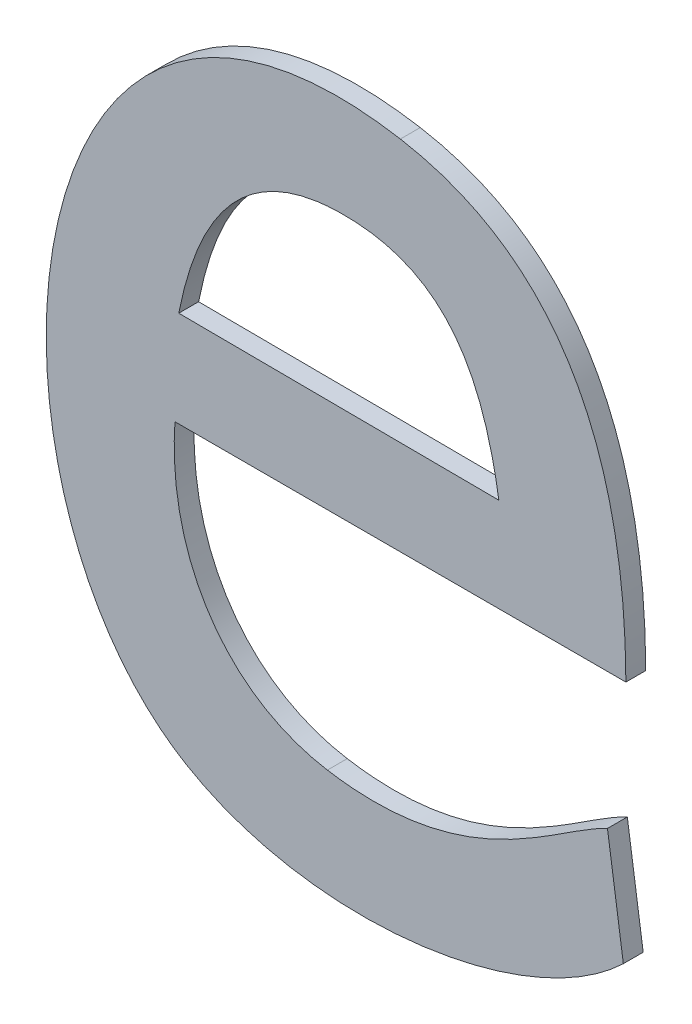
ISO-10303-21;
HEADER;
FILE_DESCRIPTION(('STEP AP214'),'2;1');
FILE_NAME('part.step','',(''),(''),'','','');
FILE_SCHEMA(('AUTOMOTIVE_DESIGN { 1 0 10303 214 1 1 1 1 }'));
ENDSEC;
DATA;
#1=APPLICATION_CONTEXT('core data for automotive mechanical design processes');
#2=APPLICATION_PROTOCOL_DEFINITION('international standard','automotive_design',2000,#1);
#3=PRODUCT_CONTEXT('',#1,'mechanical');
#4=PRODUCT('Part','Part','',(#3));
#5=PRODUCT_RELATED_PRODUCT_CATEGORY('part','',(#4));
#6=PRODUCT_DEFINITION_FORMATION('','',#4);
#7=PRODUCT_DEFINITION_CONTEXT('part definition',#1,'design');
#8=PRODUCT_DEFINITION('design','',#6,#7);
#9=PRODUCT_DEFINITION_SHAPE('','',#8);
#10=(LENGTH_UNIT() NAMED_UNIT(*) SI_UNIT(.MILLI.,.METRE.));
#11=(NAMED_UNIT(*) PLANE_ANGLE_UNIT() SI_UNIT($,.RADIAN.));
#12=(NAMED_UNIT(*) SI_UNIT($,.STERADIAN.) SOLID_ANGLE_UNIT());
#13=UNCERTAINTY_MEASURE_WITH_UNIT(LENGTH_MEASURE(1.E-05),#10,'distance_accuracy_value','');
#14=(GEOMETRIC_REPRESENTATION_CONTEXT(3) GLOBAL_UNCERTAINTY_ASSIGNED_CONTEXT((#13)) GLOBAL_UNIT_ASSIGNED_CONTEXT((#10,
#11,#12)) REPRESENTATION_CONTEXT('',''));
#15=CARTESIAN_POINT('',(0.,0.,0.));
#16=DIRECTION('',(0.,0.,1.));
#17=DIRECTION('',(1.,0.,0.));
#18=AXIS2_PLACEMENT_3D('',#15,#16,#17);
#19=CARTESIAN_POINT('',(-1.74399140625,-48.604259609375,0.001));
#20=CARTESIAN_POINT('',(-1.74399140625,-48.604259609375,0.));
#21=CARTESIAN_POINT('',(-1.763890546875,-48.6008364453125,0.001));
#22=CARTESIAN_POINT('',(-1.763890546875,-48.6008364453125,0.));
#23=CARTESIAN_POINT('',(-1.7666098828125,-48.6298853515625,0.001));
#24=CARTESIAN_POINT('',(-1.7666098828125,-48.6298853515625,0.));
#25=CARTESIAN_POINT('',(-1.754804765625,-48.6369236328125,0.001));
#26=CARTESIAN_POINT('',(-1.754804765625,-48.6369236328125,0.));
#27=B_SPLINE_SURFACE_WITH_KNOTS('',3,1,((#19,#20),(#21,#22),(#23,#24),(#25,#26)),.UNSPECIFIED.,
.F.,.F.,.F.,(4,4),(2,2),(0.5,0.625),(0.,1.),.UNSPECIFIED.);
#28=CARTESIAN_POINT('',(-1.74399140625,-48.604259609375,0.));
#29=CARTESIAN_POINT('',(-1.763890546875,-48.6008364453125,0.));
#30=CARTESIAN_POINT('',(-1.7666098828125,-48.6298853515625,0.));
#31=CARTESIAN_POINT('',(-1.754804765625,-48.6369236328125,0.));
#32=B_SPLINE_CURVE_WITH_KNOTS('',3,(#28,#29,#30,#31),.UNSPECIFIED.,.F.,.F.,(4,4),(0.5,0.625),.UNSPECIFIED.);
#33=CARTESIAN_POINT('',(-1.74399140625,-48.604259609375,0.));
#34=VERTEX_POINT('',#33);
#35=CARTESIAN_POINT('',(-1.754804765625,-48.6369236328125,0.));
#36=VERTEX_POINT('',#35);
#37=EDGE_CURVE('E11',#34,#36,#32,.T.);
#38=DIRECTION('',(0.,0.,-1.));
#39=VECTOR('',#38,1.);
#40=CARTESIAN_POINT('',(-1.754804765625,-48.6369236328125,0.001));
#41=LINE('',#40,#39);
#42=CARTESIAN_POINT('',(-1.754804765625,-48.6369236328125,0.001));
#43=VERTEX_POINT('',#42);
#44=EDGE_CURVE('E28',#43,#36,#41,.T.);
#45=CARTESIAN_POINT('',(-1.74399140625,-48.604259609375,0.001));
#46=CARTESIAN_POINT('',(-1.763890546875,-48.6008364453125,0.001));
#47=CARTESIAN_POINT('',(-1.7666098828125,-48.6298853515625,0.001));
#48=CARTESIAN_POINT('',(-1.754804765625,-48.6369236328125,0.001));
#49=B_SPLINE_CURVE_WITH_KNOTS('',3,(#45,#46,#47,#48),.UNSPECIFIED.,.F.,.F.,(4,4),(0.5,0.625),.UNSPECIFIED.);
#50=CARTESIAN_POINT('',(-1.74399140625,-48.604259609375,0.001));
#51=VERTEX_POINT('',#50);
#52=EDGE_CURVE('E225',#51,#43,#49,.T.);
#53=DIRECTION('',(0.,0.,-1.));
#54=VECTOR('',#53,1.);
#55=CARTESIAN_POINT('',(-1.74399140625,-48.604259609375,0.001));
#56=LINE('',#55,#54);
#57=EDGE_CURVE('E40',#51,#34,#56,.T.);
#58=ORIENTED_EDGE('',*,*,#37,.T.);
#59=ORIENTED_EDGE('',*,*,#44,.F.);
#60=ORIENTED_EDGE('',*,*,#52,.F.);
#61=ORIENTED_EDGE('',*,*,#57,.T.);
#62=EDGE_LOOP('',(#58,#59,#60,#61));
#63=FACE_BOUND('',#62,.T.);
#64=ADVANCED_FACE('F17',(#63),#27,.F.);
#65=CARTESIAN_POINT('',(-1.754804765625,-48.6369236328125,0.001));
#66=CARTESIAN_POINT('',(-1.754804765625,-48.6369236328125,0.));
#67=CARTESIAN_POINT('',(-1.7483743359375,-48.6407626953125,0.001));
#68=CARTESIAN_POINT('',(-1.7483743359375,-48.6407626953125,0.));
#69=CARTESIAN_POINT('',(-1.73759296875,-48.6392590625,0.001));
#70=CARTESIAN_POINT('',(-1.73759296875,-48.6392590625,0.));
#71=CARTESIAN_POINT('',(-1.7327621484375,-48.6346201953125,0.001));
#72=CARTESIAN_POINT('',(-1.7327621484375,-48.6346201953125,0.));
#73=B_SPLINE_SURFACE_WITH_KNOTS('',3,1,((#65,#66),(#67,#68),(#69,#70),(#71,#72)),.UNSPECIFIED.,
.F.,.F.,.F.,(4,4),(2,2),(0.625,0.75),(0.,1.),.UNSPECIFIED.);
#74=CARTESIAN_POINT('',(-1.754804765625,-48.6369236328125,0.));
#75=CARTESIAN_POINT('',(-1.7483743359375,-48.6407626953125,0.));
#76=CARTESIAN_POINT('',(-1.73759296875,-48.6392590625,0.));
#77=CARTESIAN_POINT('',(-1.7327621484375,-48.6346201953125,0.));
#78=B_SPLINE_CURVE_WITH_KNOTS('',3,(#74,#75,#76,#77),.UNSPECIFIED.,.F.,.F.,(4,4),(0.625,0.75),.UNSPECIFIED.);
#79=CARTESIAN_POINT('',(-1.7327621484375,-48.6346201953125,0.));
#80=VERTEX_POINT('',#79);
#81=EDGE_CURVE('E217',#36,#80,#78,.T.);
#82=DIRECTION('',(0.,0.,-1.));
#83=VECTOR('',#82,1.);
#84=CARTESIAN_POINT('',(-1.7327621484375,-48.6346201953125,0.001));
#85=LINE('',#84,#83);
#86=CARTESIAN_POINT('',(-1.7327621484375,-48.6346201953125,0.001));
#87=VERTEX_POINT('',#86);
#88=EDGE_CURVE('E212',#87,#80,#85,.T.);
#89=CARTESIAN_POINT('',(-1.754804765625,-48.6369236328125,0.001));
#90=CARTESIAN_POINT('',(-1.7483743359375,-48.6407626953125,0.001));
#91=CARTESIAN_POINT('',(-1.73759296875,-48.6392590625,0.001));
#92=CARTESIAN_POINT('',(-1.7327621484375,-48.6346201953125,0.001));
#93=B_SPLINE_CURVE_WITH_KNOTS('',3,(#89,#90,#91,#92),.UNSPECIFIED.,.F.,.F.,(4,4),(0.625,0.75),.UNSPECIFIED.);
#94=EDGE_CURVE('E208',#43,#87,#93,.T.);
#95=ORIENTED_EDGE('',*,*,#81,.T.);
#96=ORIENTED_EDGE('',*,*,#88,.F.);
#97=ORIENTED_EDGE('',*,*,#94,.F.);
#98=ORIENTED_EDGE('',*,*,#44,.T.);
#99=EDGE_LOOP('',(#95,#96,#97,#98));
#100=FACE_BOUND('',#99,.T.);
#101=ADVANCED_FACE('F235',(#100),#73,.F.);
#102=CARTESIAN_POINT('',(-8.6196465371108,-1.2528556013265,0.001));
#103=DIRECTION('',(-0.989601334587177,-0.143837403283281,0.));
#104=DIRECTION('',(0.143837403283281,-0.989601334587177,0.));
#105=AXIS2_PLACEMENT_3D('',#102,#103,#104);
#106=PLANE('',#105);
#107=DIRECTION('',(-0.143837403283281,0.989601334587177,0.));
#108=VECTOR('',#107,1.);
#109=CARTESIAN_POINT('',(-8.6196465371108,-1.2528556013265,0.));
#110=LINE('',#109,#108);
#111=CARTESIAN_POINT('',(-1.733561953125,-48.6291175390625,0.));
#112=VERTEX_POINT('',#111);
#113=EDGE_CURVE('E206',#80,#112,#110,.T.);
#114=ORIENTED_EDGE('',*,*,#113,.T.);
#115=DIRECTION('',(0.,0.,-1.));
#116=VECTOR('',#115,1.);
#117=CARTESIAN_POINT('',(-1.733561953125,-48.6291175390625,0.001));
#118=LINE('',#117,#116);
#119=CARTESIAN_POINT('',(-1.733561953125,-48.6291175390625,0.001));
#120=VERTEX_POINT('',#119);
#121=EDGE_CURVE('E203',#120,#112,#118,.T.);
#122=ORIENTED_EDGE('',*,*,#121,.F.);
#123=DIRECTION('',(-0.143837403283281,0.989601334587177,0.));
#124=VECTOR('',#123,1.);
#125=CARTESIAN_POINT('',(-8.6196465371108,-1.2528556013265,0.001));
#126=LINE('',#125,#124);
#127=EDGE_CURVE('E197',#87,#120,#126,.T.);
#128=ORIENTED_EDGE('',*,*,#127,.F.);
#129=ORIENTED_EDGE('',*,*,#88,.T.);
#130=EDGE_LOOP('',(#114,#122,#128,#129));
#131=FACE_BOUND('',#130,.T.);
#132=ADVANCED_FACE('F239',(#131),#106,.F.);
#133=CARTESIAN_POINT('',(-1.733561953125,-48.6291175390625,0.001));
#134=CARTESIAN_POINT('',(-1.733561953125,-48.6291175390625,0.));
#135=CARTESIAN_POINT('',(-1.736249296875,-48.630365234375,0.001));
#136=CARTESIAN_POINT('',(-1.736249296875,-48.630365234375,0.));
#137=CARTESIAN_POINT('',(-1.7405042578125,-48.6348121484375,0.001));
#138=CARTESIAN_POINT('',(-1.7405042578125,-48.6348121484375,0.));
#139=CARTESIAN_POINT('',(-1.7476705078125,-48.6336284375,0.001));
#140=CARTESIAN_POINT('',(-1.7476705078125,-48.6336284375,0.));
#141=B_SPLINE_SURFACE_WITH_KNOTS('',3,1,((#133,#134),(#135,#136),(#137,#138),(#139,#140)),
.UNSPECIFIED.,.F.,.F.,.F.,(4,4),(2,2),(0.,0.125),(0.,1.),.UNSPECIFIED.);
#142=CARTESIAN_POINT('',(-1.733561953125,-48.6291175390625,0.));
#143=CARTESIAN_POINT('',(-1.736249296875,-48.630365234375,0.));
#144=CARTESIAN_POINT('',(-1.7405042578125,-48.6348121484375,0.));
#145=CARTESIAN_POINT('',(-1.7476705078125,-48.6336284375,0.));
#146=B_SPLINE_CURVE_WITH_KNOTS('',3,(#142,#143,#144,#145),.UNSPECIFIED.,.F.,.F.,(4,4),(0.,
0.125),.UNSPECIFIED.);
#147=CARTESIAN_POINT('',(-1.7476705078125,-48.6336284375,0.));
#148=VERTEX_POINT('',#147);
#149=EDGE_CURVE('E192',#112,#148,#146,.T.);
#150=DIRECTION('',(0.,0.,-1.));
#151=VECTOR('',#150,1.);
#152=CARTESIAN_POINT('',(-1.7476705078125,-48.6336284375,0.001));
#153=LINE('',#152,#151);
#154=CARTESIAN_POINT('',(-1.7476705078125,-48.6336284375,0.001));
#155=VERTEX_POINT('',#154);
#156=EDGE_CURVE('E187',#155,#148,#153,.T.);
#157=CARTESIAN_POINT('',(-1.733561953125,-48.6291175390625,0.001));
#158=CARTESIAN_POINT('',(-1.736249296875,-48.630365234375,0.001));
#159=CARTESIAN_POINT('',(-1.7405042578125,-48.6348121484375,0.001));
#160=CARTESIAN_POINT('',(-1.7476705078125,-48.6336284375,0.001));
#161=B_SPLINE_CURVE_WITH_KNOTS('',3,(#157,#158,#159,#160),.UNSPECIFIED.,.F.,.F.,(4,4),(0.,
0.125),.UNSPECIFIED.);
#162=EDGE_CURVE('E180',#120,#155,#161,.T.);
#163=ORIENTED_EDGE('',*,*,#149,.T.);
#164=ORIENTED_EDGE('',*,*,#156,.F.);
#165=ORIENTED_EDGE('',*,*,#162,.F.);
#166=ORIENTED_EDGE('',*,*,#121,.T.);
#167=EDGE_LOOP('',(#163,#164,#165,#166));
#168=FACE_BOUND('',#167,.T.);
#169=ADVANCED_FACE('F243',(#168),#141,.F.);
#170=CARTESIAN_POINT('',(-1.7476705078125,-48.6336284375,0.001));
#171=CARTESIAN_POINT('',(-1.7476705078125,-48.6336284375,0.));
#172=CARTESIAN_POINT('',(-1.75269328125,-48.632796640625,0.001));
#173=CARTESIAN_POINT('',(-1.75269328125,-48.632796640625,0.));
#174=CARTESIAN_POINT('',(-1.75576453125,-48.628317734375,0.001));
#175=CARTESIAN_POINT('',(-1.75576453125,-48.628317734375,0.));
#176=CARTESIAN_POINT('',(-1.7553486328125,-48.6222712109375,0.001));
#177=CARTESIAN_POINT('',(-1.7553486328125,-48.6222712109375,0.));
#178=B_SPLINE_SURFACE_WITH_KNOTS('',3,1,((#170,#171),(#172,#173),(#174,#175),(#176,#177)),
.UNSPECIFIED.,.F.,.F.,.F.,(4,4),(2,2),(0.125,0.25),(0.,1.),.UNSPECIFIED.);
#179=CARTESIAN_POINT('',(-1.7476705078125,-48.6336284375,0.));
#180=CARTESIAN_POINT('',(-1.75269328125,-48.632796640625,0.));
#181=CARTESIAN_POINT('',(-1.75576453125,-48.628317734375,0.));
#182=CARTESIAN_POINT('',(-1.7553486328125,-48.6222712109375,0.));
#183=B_SPLINE_CURVE_WITH_KNOTS('',3,(#179,#180,#181,#182),.UNSPECIFIED.,.F.,.F.,(4,4),(0.125,
0.25),.UNSPECIFIED.);
#184=CARTESIAN_POINT('',(-1.7553486328125,-48.6222712109375,0.));
#185=VERTEX_POINT('',#184);
#186=EDGE_CURVE('E175',#148,#185,#183,.T.);
#187=DIRECTION('',(0.,0.,-1.));
#188=VECTOR('',#187,1.);
#189=CARTESIAN_POINT('',(-1.7553486328125,-48.6222712109375,0.001));
#190=LINE('',#189,#188);
#191=CARTESIAN_POINT('',(-1.7553486328125,-48.6222712109375,0.001));
#192=VERTEX_POINT('',#191);
#193=EDGE_CURVE('E170',#192,#185,#190,.T.);
#194=CARTESIAN_POINT('',(-1.7476705078125,-48.6336284375,0.001));
#195=CARTESIAN_POINT('',(-1.75269328125,-48.632796640625,0.001));
#196=CARTESIAN_POINT('',(-1.75576453125,-48.628317734375,0.001));
#197=CARTESIAN_POINT('',(-1.7553486328125,-48.6222712109375,0.001));
#198=B_SPLINE_CURVE_WITH_KNOTS('',3,(#194,#195,#196,#197),.UNSPECIFIED.,.F.,.F.,(4,4),(0.125,
0.25),.UNSPECIFIED.);
#199=EDGE_CURVE('E166',#155,#192,#198,.T.);
#200=ORIENTED_EDGE('',*,*,#186,.T.);
#201=ORIENTED_EDGE('',*,*,#193,.F.);
#202=ORIENTED_EDGE('',*,*,#199,.F.);
#203=ORIENTED_EDGE('',*,*,#156,.T.);
#204=EDGE_LOOP('',(#200,#201,#202,#203));
#205=FACE_BOUND('',#204,.T.);
#206=ADVANCED_FACE('F249',(#205),#178,.F.);
#207=CARTESIAN_POINT('',(0.,-48.6222712109375,0.001));
#208=DIRECTION('',(0.,1.,0.));
#209=DIRECTION('',(0.,0.,1.));
#210=AXIS2_PLACEMENT_3D('',#207,#208,#209);
#211=PLANE('',#210);
#212=DIRECTION('',(1.,0.,0.));
#213=VECTOR('',#212,1.);
#214=CARTESIAN_POINT('',(0.,-48.6222712109375,0.));
#215=LINE('',#214,#213);
#216=CARTESIAN_POINT('',(-1.7326341796875,-48.6222712109375,0.));
#217=VERTEX_POINT('',#216);
#218=EDGE_CURVE('E164',#185,#217,#215,.T.);
#219=ORIENTED_EDGE('',*,*,#218,.T.);
#220=DIRECTION('',(0.,0.,-1.));
#221=VECTOR('',#220,1.);
#222=CARTESIAN_POINT('',(-1.7326341796875,-48.6222712109375,0.001));
#223=LINE('',#222,#221);
#224=CARTESIAN_POINT('',(-1.7326341796875,-48.6222712109375,0.001));
#225=VERTEX_POINT('',#224);
#226=EDGE_CURVE('E161',#225,#217,#223,.T.);
#227=ORIENTED_EDGE('',*,*,#226,.F.);
#228=DIRECTION('',(1.,0.,0.));
#229=VECTOR('',#228,1.);
#230=CARTESIAN_POINT('',(0.,-48.6222712109375,0.001));
#231=LINE('',#230,#229);
#232=EDGE_CURVE('E155',#192,#225,#231,.T.);
#233=ORIENTED_EDGE('',*,*,#232,.F.);
#234=ORIENTED_EDGE('',*,*,#193,.T.);
#235=EDGE_LOOP('',(#219,#227,#233,#234));
#236=FACE_BOUND('',#235,.T.);
#237=ADVANCED_FACE('F263',(#236),#211,.F.);
#238=CARTESIAN_POINT('',(-1.7551566796875,-48.617440390625,0.001));
#239=CARTESIAN_POINT('',(-1.7551566796875,-48.617440390625,0.));
#240=CARTESIAN_POINT('',(-1.7542608984375,-48.6128975,0.001));
#241=CARTESIAN_POINT('',(-1.7542608984375,-48.6128975,0.));
#242=CARTESIAN_POINT('',(-1.752117421875,-48.609122421875,0.001));
#243=CARTESIAN_POINT('',(-1.752117421875,-48.609122421875,0.));
#244=CARTESIAN_POINT('',(-1.747126640625,-48.608994453125,0.001));
#245=CARTESIAN_POINT('',(-1.747126640625,-48.608994453125,0.));
#246=B_SPLINE_SURFACE_WITH_KNOTS('',3,1,((#238,#239),(#240,#241),(#242,#243),(#244,#245)),
.UNSPECIFIED.,.F.,.F.,.F.,(4,4),(2,2),(0.,0.25),(0.,1.),.UNSPECIFIED.);
#247=CARTESIAN_POINT('',(-1.7551566796875,-48.617440390625,0.));
#248=CARTESIAN_POINT('',(-1.7542608984375,-48.6128975,0.));
#249=CARTESIAN_POINT('',(-1.752117421875,-48.609122421875,0.));
#250=CARTESIAN_POINT('',(-1.747126640625,-48.608994453125,0.));
#251=B_SPLINE_CURVE_WITH_KNOTS('',3,(#247,#248,#249,#250),.UNSPECIFIED.,.F.,.F.,(4,4),(0.,0.25),.UNSPECIFIED.);
#252=CARTESIAN_POINT('',(-1.7551566796875,-48.617440390625,0.));
#253=VERTEX_POINT('',#252);
#254=CARTESIAN_POINT('',(-1.747126640625,-48.608994453125,0.));
#255=VERTEX_POINT('',#254);
#256=EDGE_CURVE('E150',#253,#255,#251,.T.);
#257=DIRECTION('',(0.,0.,-1.));
#258=VECTOR('',#257,1.);
#259=CARTESIAN_POINT('',(-1.747126640625,-48.608994453125,0.001));
#260=LINE('',#259,#258);
#261=CARTESIAN_POINT('',(-1.747126640625,-48.608994453125,0.001));
#262=VERTEX_POINT('',#261);
#263=EDGE_CURVE('E145',#262,#255,#260,.T.);
#264=CARTESIAN_POINT('',(-1.7551566796875,-48.617440390625,0.001));
#265=CARTESIAN_POINT('',(-1.7542608984375,-48.6128975,0.001));
#266=CARTESIAN_POINT('',(-1.752117421875,-48.609122421875,0.001));
#267=CARTESIAN_POINT('',(-1.747126640625,-48.608994453125,0.001));
#268=B_SPLINE_CURVE_WITH_KNOTS('',3,(#264,#265,#266,#267),.UNSPECIFIED.,.F.,.F.,(4,4),(0.,0.25),.UNSPECIFIED.);
#269=CARTESIAN_POINT('',(-1.7551566796875,-48.617440390625,0.001));
#270=VERTEX_POINT('',#269);
#271=EDGE_CURVE('E104',#270,#262,#268,.T.);
#272=DIRECTION('',(0.,0.,-1.));
#273=VECTOR('',#272,1.);
#274=CARTESIAN_POINT('',(-1.7551566796875,-48.617440390625,0.001));
#275=LINE('',#274,#273);
#276=EDGE_CURVE('E119',#270,#253,#275,.T.);
#277=ORIENTED_EDGE('',*,*,#256,.T.);
#278=ORIENTED_EDGE('',*,*,#263,.F.);
#279=ORIENTED_EDGE('',*,*,#271,.F.);
#280=ORIENTED_EDGE('',*,*,#276,.T.);
#281=EDGE_LOOP('',(#277,#278,#279,#280));
#282=FACE_BOUND('',#281,.T.);
#283=ADVANCED_FACE('F265',(#282),#246,.F.);
#284=CARTESIAN_POINT('',(-1.747126640625,-48.608994453125,0.001));
#285=CARTESIAN_POINT('',(-1.747126640625,-48.608994453125,0.));
#286=CARTESIAN_POINT('',(-1.74168796875,-48.608866484375,0.001));
#287=CARTESIAN_POINT('',(-1.74168796875,-48.608866484375,0.));
#288=CARTESIAN_POINT('',(-1.739832421875,-48.6125455859375,0.001));
#289=CARTESIAN_POINT('',(-1.739832421875,-48.6125455859375,0.));
#290=CARTESIAN_POINT('',(-1.7390326171875,-48.6175363671875,0.001));
#291=CARTESIAN_POINT('',(-1.7390326171875,-48.6175363671875,0.));
#292=B_SPLINE_SURFACE_WITH_KNOTS('',3,1,((#284,#285),(#286,#287),(#288,#289),(#290,#291)),
.UNSPECIFIED.,.F.,.F.,.F.,(4,4),(2,2),(0.25,0.5),(0.,1.),.UNSPECIFIED.);
#293=CARTESIAN_POINT('',(-1.747126640625,-48.608994453125,0.));
#294=CARTESIAN_POINT('',(-1.74168796875,-48.608866484375,0.));
#295=CARTESIAN_POINT('',(-1.739832421875,-48.6125455859375,0.));
#296=CARTESIAN_POINT('',(-1.7390326171875,-48.6175363671875,0.));
#297=B_SPLINE_CURVE_WITH_KNOTS('',3,(#293,#294,#295,#296),.UNSPECIFIED.,.F.,.F.,(4,4),(0.25,
0.5),.UNSPECIFIED.);
#298=CARTESIAN_POINT('',(-1.7390326171875,-48.6175363671875,0.));
#299=VERTEX_POINT('',#298);
#300=EDGE_CURVE('E113',#255,#299,#297,.T.);
#301=DIRECTION('',(0.,0.,-1.));
#302=VECTOR('',#301,1.);
#303=CARTESIAN_POINT('',(-1.7390326171875,-48.6175363671875,0.001));
#304=LINE('',#303,#302);
#305=CARTESIAN_POINT('',(-1.7390326171875,-48.6175363671875,0.001));
#306=VERTEX_POINT('',#305);
#307=EDGE_CURVE('E107',#306,#299,#304,.T.);
#308=CARTESIAN_POINT('',(-1.747126640625,-48.608994453125,0.001));
#309=CARTESIAN_POINT('',(-1.74168796875,-48.608866484375,0.001));
#310=CARTESIAN_POINT('',(-1.739832421875,-48.6125455859375,0.001));
#311=CARTESIAN_POINT('',(-1.7390326171875,-48.6175363671875,0.001));
#312=B_SPLINE_CURVE_WITH_KNOTS('',3,(#308,#309,#310,#311),.UNSPECIFIED.,.F.,.F.,(4,4),(0.25,
0.5),.UNSPECIFIED.);
#313=EDGE_CURVE('E97',#262,#306,#312,.T.);
#314=ORIENTED_EDGE('',*,*,#300,.T.);
#315=ORIENTED_EDGE('',*,*,#307,.F.);
#316=ORIENTED_EDGE('',*,*,#313,.F.);
#317=ORIENTED_EDGE('',*,*,#263,.T.);
#318=EDGE_LOOP('',(#314,#315,#316,#317));
#319=FACE_BOUND('',#318,.T.);
#320=ADVANCED_FACE('F111',(#319),#292,.F.);
#321=CARTESIAN_POINT('',(-0.289441457622042,-48.6261648859935,0.001));
#322=DIRECTION('',(-0.0059522755055853,-0.999982285051243,0.));
#323=DIRECTION('',(0.999982285051243,-0.0059522755055853,0.));
#324=AXIS2_PLACEMENT_3D('',#321,#322,#323);
#325=PLANE('',#324);
#326=DIRECTION('',(-0.999982285051243,0.0059522755055853,0.));
#327=VECTOR('',#326,1.);
#328=CARTESIAN_POINT('',(-0.289441457622042,-48.6261648859935,0.));
#329=LINE('',#328,#327);
#330=EDGE_CURVE('E108',#299,#253,#329,.T.);
#331=ORIENTED_EDGE('',*,*,#330,.T.);
#332=ORIENTED_EDGE('',*,*,#276,.F.);
#333=DIRECTION('',(-0.999982285051243,0.0059522755055853,0.));
#334=VECTOR('',#333,1.);
#335=CARTESIAN_POINT('',(-0.289441457622042,-48.6261648859935,0.001));
#336=LINE('',#335,#334);
#337=EDGE_CURVE('E102',#306,#270,#336,.T.);
#338=ORIENTED_EDGE('',*,*,#337,.F.);
#339=ORIENTED_EDGE('',*,*,#307,.T.);
#340=EDGE_LOOP('',(#331,#332,#338,#339));
#341=FACE_BOUND('',#340,.T.);
#342=ADVANCED_FACE('F118',(#341),#325,.F.);
#343=CARTESIAN_POINT('',(-1.7326341796875,-48.6222712109375,0.001));
#344=CARTESIAN_POINT('',(-1.7326341796875,-48.6222712109375,0.));
#345=CARTESIAN_POINT('',(-1.732666171875,-48.612833515625,0.001));
#346=CARTESIAN_POINT('',(-1.732666171875,-48.612833515625,0.));
#347=CARTESIAN_POINT('',(-1.7357054296875,-48.6056992578125,0.001));
#348=CARTESIAN_POINT('',(-1.7357054296875,-48.6056992578125,0.));
#349=CARTESIAN_POINT('',(-1.74399140625,-48.604259609375,0.001));
#350=CARTESIAN_POINT('',(-1.74399140625,-48.604259609375,0.));
#351=B_SPLINE_SURFACE_WITH_KNOTS('',3,1,((#343,#344),(#345,#346),(#347,#348),(#349,#350)),
.UNSPECIFIED.,.F.,.F.,.F.,(4,4),(2,2),(0.375,0.5),(0.,1.),.UNSPECIFIED.);
#352=CARTESIAN_POINT('',(-1.7326341796875,-48.6222712109375,0.));
#353=CARTESIAN_POINT('',(-1.732666171875,-48.612833515625,0.));
#354=CARTESIAN_POINT('',(-1.7357054296875,-48.6056992578125,0.));
#355=CARTESIAN_POINT('',(-1.74399140625,-48.604259609375,0.));
#356=B_SPLINE_CURVE_WITH_KNOTS('',3,(#352,#353,#354,#355),.UNSPECIFIED.,.F.,.F.,(4,4),(0.375,
0.5),.UNSPECIFIED.);
#357=EDGE_CURVE('E120',#217,#34,#356,.T.);
#358=CARTESIAN_POINT('',(-1.7326341796875,-48.6222712109375,0.001));
#359=CARTESIAN_POINT('',(-1.732666171875,-48.612833515625,0.001));
#360=CARTESIAN_POINT('',(-1.7357054296875,-48.6056992578125,0.001));
#361=CARTESIAN_POINT('',(-1.74399140625,-48.604259609375,0.001));
#362=B_SPLINE_CURVE_WITH_KNOTS('',3,(#358,#359,#360,#361),.UNSPECIFIED.,.F.,.F.,(4,4),(0.375,
0.5),.UNSPECIFIED.);
#363=EDGE_CURVE('E124',#225,#51,#362,.T.);
#364=ORIENTED_EDGE('',*,*,#357,.T.);
#365=ORIENTED_EDGE('',*,*,#57,.F.);
#366=ORIENTED_EDGE('',*,*,#363,.F.);
#367=ORIENTED_EDGE('',*,*,#226,.T.);
#368=EDGE_LOOP('',(#364,#365,#366,#367));
#369=FACE_BOUND('',#368,.T.);
#370=ADVANCED_FACE('F253',(#369),#351,.F.);
#371=CARTESIAN_POINT('',(0.,0.,0.001));
#372=DIRECTION('',(0.,0.,1.));
#373=DIRECTION('',(1.,0.,0.));
#374=AXIS2_PLACEMENT_3D('',#371,#372,#373);
#375=PLANE('',#374);
#376=ORIENTED_EDGE('',*,*,#271,.T.);
#377=ORIENTED_EDGE('',*,*,#313,.T.);
#378=ORIENTED_EDGE('',*,*,#337,.T.);
#379=EDGE_LOOP('',(#376,#377,#378));
#380=FACE_BOUND('',#379,.T.);
#381=ORIENTED_EDGE('',*,*,#52,.T.);
#382=ORIENTED_EDGE('',*,*,#94,.T.);
#383=ORIENTED_EDGE('',*,*,#127,.T.);
#384=ORIENTED_EDGE('',*,*,#162,.T.);
#385=ORIENTED_EDGE('',*,*,#199,.T.);
#386=ORIENTED_EDGE('',*,*,#232,.T.);
#387=ORIENTED_EDGE('',*,*,#363,.T.);
#388=EDGE_LOOP('',(#381,#382,#383,#384,#385,#386,#387));
#389=FACE_BOUND('',#388,.T.);
#390=ADVANCED_FACE('F99',(#380,#389),#375,.T.);
#391=CARTESIAN_POINT('',(0.,0.,0.));
#392=DIRECTION('',(0.,0.,1.));
#393=DIRECTION('',(1.,0.,0.));
#394=AXIS2_PLACEMENT_3D('',#391,#392,#393);
#395=PLANE('',#394);
#396=ORIENTED_EDGE('',*,*,#256,.F.);
#397=ORIENTED_EDGE('',*,*,#330,.F.);
#398=ORIENTED_EDGE('',*,*,#300,.F.);
#399=EDGE_LOOP('',(#396,#397,#398));
#400=FACE_BOUND('',#399,.T.);
#401=ORIENTED_EDGE('',*,*,#37,.F.);
#402=ORIENTED_EDGE('',*,*,#357,.F.);
#403=ORIENTED_EDGE('',*,*,#218,.F.);
#404=ORIENTED_EDGE('',*,*,#186,.F.);
#405=ORIENTED_EDGE('',*,*,#149,.F.);
#406=ORIENTED_EDGE('',*,*,#113,.F.);
#407=ORIENTED_EDGE('',*,*,#81,.F.);
#408=EDGE_LOOP('',(#401,#402,#403,#404,#405,#406,#407));
#409=FACE_BOUND('',#408,.T.);
#410=ADVANCED_FACE('F262',(#400,#409),#395,.F.);
#411=CLOSED_SHELL('',(#64,#101,#132,#169,#206,#237,#283,#320,#342,#370,#390,#410));
#412=MANIFOLD_SOLID_BREP('B1',#411);
#413=ADVANCED_BREP_SHAPE_REPRESENTATION('',(#18,#412),#14);
#414=SHAPE_DEFINITION_REPRESENTATION(#9,#413);
ENDSEC;
END-ISO-10303-21;
